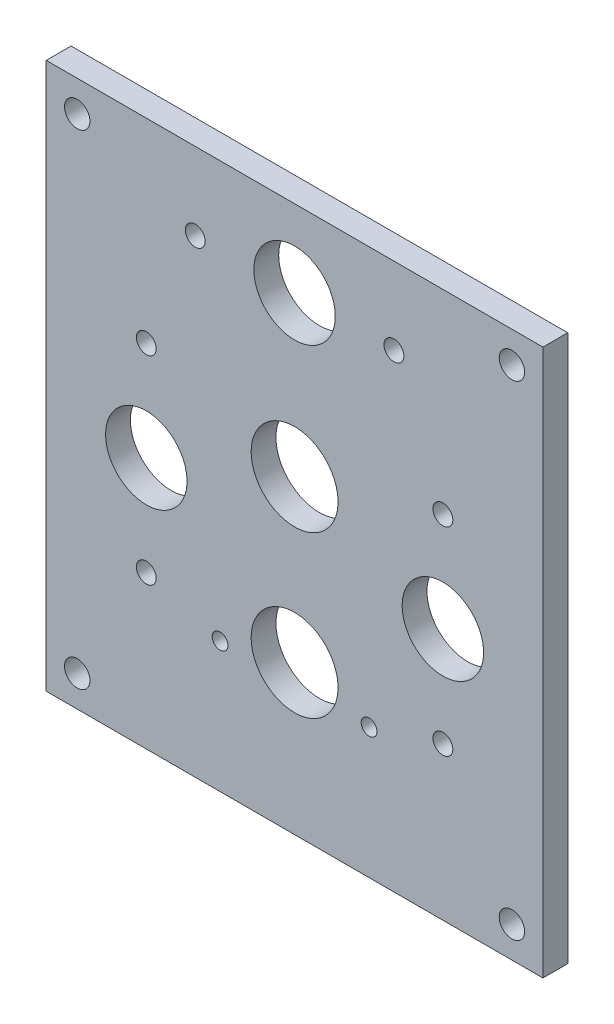
ISO-10303-21;
HEADER;
FILE_DESCRIPTION(('STEP AP214'),'2;1');
FILE_NAME('part.step','',(''),(''),'','','');
FILE_SCHEMA(('AUTOMOTIVE_DESIGN { 1 0 10303 214 1 1 1 1 }'));
ENDSEC;
DATA;
#1=APPLICATION_CONTEXT('core data for automotive mechanical design processes');
#2=APPLICATION_PROTOCOL_DEFINITION('international standard','automotive_design',2000,#1);
#3=PRODUCT_CONTEXT('',#1,'mechanical');
#4=PRODUCT('Part','Part','',(#3));
#5=PRODUCT_RELATED_PRODUCT_CATEGORY('part','',(#4));
#6=PRODUCT_DEFINITION_FORMATION('','',#4);
#7=PRODUCT_DEFINITION_CONTEXT('part definition',#1,'design');
#8=PRODUCT_DEFINITION('design','',#6,#7);
#9=PRODUCT_DEFINITION_SHAPE('','',#8);
#10=(LENGTH_UNIT() NAMED_UNIT(*) SI_UNIT(.MILLI.,.METRE.));
#11=(NAMED_UNIT(*) PLANE_ANGLE_UNIT() SI_UNIT($,.RADIAN.));
#12=(NAMED_UNIT(*) SI_UNIT($,.STERADIAN.) SOLID_ANGLE_UNIT());
#13=UNCERTAINTY_MEASURE_WITH_UNIT(LENGTH_MEASURE(1.E-05),#10,'distance_accuracy_value','');
#14=(GEOMETRIC_REPRESENTATION_CONTEXT(3) GLOBAL_UNCERTAINTY_ASSIGNED_CONTEXT((#13)) GLOBAL_UNIT_ASSIGNED_CONTEXT((#10,
#11,#12)) REPRESENTATION_CONTEXT('',''));
#15=CARTESIAN_POINT('',(0.,0.,0.));
#16=DIRECTION('',(0.,0.,1.));
#17=DIRECTION('',(1.,0.,0.));
#18=AXIS2_PLACEMENT_3D('',#15,#16,#17);
#19=CARTESIAN_POINT('',(63.5,-38.1,28.5749999999999));
#20=DIRECTION('',(0.,0.,-1.));
#21=DIRECTION('',(-1.,0.,0.));
#22=AXIS2_PLACEMENT_3D('',#19,#20,#21);
#23=PLANE('',#22);
#24=DIRECTION('',(0.,1.,0.));
#25=VECTOR('',#24,1.);
#26=CARTESIAN_POINT('',(-63.5,101.6,28.5749999999999));
#27=LINE('',#26,#25);
#28=CARTESIAN_POINT('',(-63.5,-38.1,28.5749999999999));
#29=VERTEX_POINT('',#28);
#30=CARTESIAN_POINT('',(-63.5,101.6,28.5749999999999));
#31=VERTEX_POINT('',#30);
#32=EDGE_CURVE('E55',#29,#31,#27,.T.);
#33=ORIENTED_EDGE('',*,*,#32,.T.);
#34=DIRECTION('',(1.,0.,0.));
#35=VECTOR('',#34,1.);
#36=CARTESIAN_POINT('',(63.5,101.6,28.5749999999999));
#37=LINE('',#36,#35);
#38=CARTESIAN_POINT('',(63.5,101.6,28.5749999999999));
#39=VERTEX_POINT('',#38);
#40=EDGE_CURVE('E499',#31,#39,#37,.T.);
#41=ORIENTED_EDGE('',*,*,#40,.T.);
#42=DIRECTION('',(0.,-1.,0.));
#43=VECTOR('',#42,1.);
#44=CARTESIAN_POINT('',(63.5,101.6,28.5749999999999));
#45=LINE('',#44,#43);
#46=CARTESIAN_POINT('',(63.5,-38.1,28.5749999999999));
#47=VERTEX_POINT('',#46);
#48=EDGE_CURVE('E60',#39,#47,#45,.T.);
#49=ORIENTED_EDGE('',*,*,#48,.T.);
#50=DIRECTION('',(-1.,0.,0.));
#51=VECTOR('',#50,1.);
#52=CARTESIAN_POINT('',(63.5,-38.1,28.5749999999999));
#53=LINE('',#52,#51);
#54=EDGE_CURVE('E58',#47,#29,#53,.T.);
#55=ORIENTED_EDGE('',*,*,#54,.T.);
#56=EDGE_LOOP('',(#33,#41,#49,#55));
#57=FACE_BOUND('',#56,.T.);
#58=CARTESIAN_POINT('',(0.,41.148,28.5749999999999));
#59=DIRECTION('',(0.,0.,-1.));
#60=DIRECTION('',(-1.,0.,0.));
#61=AXIS2_PLACEMENT_3D('',#58,#59,#60);
#62=CIRCLE('',#61,11.1125);
#63=CARTESIAN_POINT('',(-11.1125,41.148,28.5749999999999));
#64=VERTEX_POINT('',#63);
#65=EDGE_CURVE('E66',#64,#64,#62,.F.);
#66=ORIENTED_EDGE('',*,*,#65,.T.);
#67=EDGE_LOOP('',(#66));
#68=FACE_BOUND('',#67,.T.);
#69=CARTESIAN_POINT('',(0.,0.,28.5749999999999));
#70=DIRECTION('',(0.,0.,-1.));
#71=DIRECTION('',(-1.,0.,0.));
#72=AXIS2_PLACEMENT_3D('',#69,#70,#71);
#73=CIRCLE('',#72,11.1125);
#74=CARTESIAN_POINT('',(-11.1124999999999,0.,28.5749999999999));
#75=VERTEX_POINT('',#74);
#76=EDGE_CURVE('E135',#75,#75,#73,.F.);
#77=ORIENTED_EDGE('',*,*,#76,.T.);
#78=EDGE_LOOP('',(#77));
#79=FACE_BOUND('',#78,.T.);
#80=CARTESIAN_POINT('',(37.9152217386642,26.3771785892618,28.5749999999999));
#81=DIRECTION('',(0.,0.,-1.));
#82=DIRECTION('',(-1.,0.,0.));
#83=AXIS2_PLACEMENT_3D('',#80,#81,#82);
#84=CIRCLE('',#83,10.414);
#85=CARTESIAN_POINT('',(27.5012217386642,26.3771785892618,28.5749999999999));
#86=VERTEX_POINT('',#85);
#87=EDGE_CURVE('E138',#86,#86,#84,.F.);
#88=ORIENTED_EDGE('',*,*,#87,.T.);
#89=EDGE_LOOP('',(#88));
#90=FACE_BOUND('',#89,.T.);
#91=CARTESIAN_POINT('',(0.,81.8388,28.5749999999999));
#92=DIRECTION('',(0.,0.,-1.));
#93=DIRECTION('',(-1.,0.,0.));
#94=AXIS2_PLACEMENT_3D('',#91,#92,#93);
#95=CIRCLE('',#94,10.414);
#96=CARTESIAN_POINT('',(-10.414,81.8388,28.5749999999999));
#97=VERTEX_POINT('',#96);
#98=EDGE_CURVE('E141',#97,#97,#95,.F.);
#99=ORIENTED_EDGE('',*,*,#98,.T.);
#100=EDGE_LOOP('',(#99));
#101=FACE_BOUND('',#100,.T.);
#102=CARTESIAN_POINT('',(-37.9152217386642,26.3771785892618,28.5749999999999));
#103=DIRECTION('',(0.,0.,-1.));
#104=DIRECTION('',(-1.,0.,0.));
#105=AXIS2_PLACEMENT_3D('',#102,#103,#104);
#106=CIRCLE('',#105,10.414);
#107=CARTESIAN_POINT('',(-48.3292217386642,26.3771785892618,28.5749999999999));
#108=VERTEX_POINT('',#107);
#109=EDGE_CURVE('E144',#108,#108,#106,.F.);
#110=ORIENTED_EDGE('',*,*,#109,.T.);
#111=EDGE_LOOP('',(#110));
#112=FACE_BOUND('',#111,.T.);
#113=CARTESIAN_POINT('',(37.9152217386642,0.977178589261784,28.5749999999999));
#114=DIRECTION('',(0.,0.,-1.));
#115=DIRECTION('',(-1.,0.,0.));
#116=AXIS2_PLACEMENT_3D('',#113,#114,#115);
#117=CIRCLE('',#116,2.54);
#118=CARTESIAN_POINT('',(35.3752217386642,0.977178589261784,28.5749999999999));
#119=VERTEX_POINT('',#118);
#120=EDGE_CURVE('E147',#119,#119,#117,.F.);
#121=ORIENTED_EDGE('',*,*,#120,.T.);
#122=EDGE_LOOP('',(#121));
#123=FACE_BOUND('',#122,.T.);
#124=CARTESIAN_POINT('',(37.9152217386642,51.7771785892618,28.5749999999999));
#125=DIRECTION('',(0.,0.,-1.));
#126=DIRECTION('',(-1.,0.,0.));
#127=AXIS2_PLACEMENT_3D('',#124,#125,#126);
#128=CIRCLE('',#127,2.54);
#129=CARTESIAN_POINT('',(35.3752217386642,51.7771785892618,28.5749999999999));
#130=VERTEX_POINT('',#129);
#131=EDGE_CURVE('E150',#130,#130,#128,.F.);
#132=ORIENTED_EDGE('',*,*,#131,.T.);
#133=EDGE_LOOP('',(#132));
#134=FACE_BOUND('',#133,.T.);
#135=CARTESIAN_POINT('',(25.4,81.8388,28.5749999999999));
#136=DIRECTION('',(0.,0.,-1.));
#137=DIRECTION('',(-1.,0.,0.));
#138=AXIS2_PLACEMENT_3D('',#135,#136,#137);
#139=CIRCLE('',#138,2.53999999999999);
#140=CARTESIAN_POINT('',(22.86,81.8388,28.5749999999999));
#141=VERTEX_POINT('',#140);
#142=EDGE_CURVE('E153',#141,#141,#139,.F.);
#143=ORIENTED_EDGE('',*,*,#142,.T.);
#144=EDGE_LOOP('',(#143));
#145=FACE_BOUND('',#144,.T.);
#146=CARTESIAN_POINT('',(-25.4,81.8388,28.5749999999999));
#147=DIRECTION('',(0.,0.,-1.));
#148=DIRECTION('',(-1.,0.,0.));
#149=AXIS2_PLACEMENT_3D('',#146,#147,#148);
#150=CIRCLE('',#149,2.53999999999999);
#151=CARTESIAN_POINT('',(-27.94,81.8388,28.5749999999999));
#152=VERTEX_POINT('',#151);
#153=EDGE_CURVE('E156',#152,#152,#150,.F.);
#154=ORIENTED_EDGE('',*,*,#153,.T.);
#155=EDGE_LOOP('',(#154));
#156=FACE_BOUND('',#155,.T.);
#157=CARTESIAN_POINT('',(-37.9152217386642,51.7771785892618,28.5749999999999));
#158=DIRECTION('',(0.,0.,-1.));
#159=DIRECTION('',(-1.,0.,0.));
#160=AXIS2_PLACEMENT_3D('',#157,#158,#159);
#161=CIRCLE('',#160,2.54);
#162=CARTESIAN_POINT('',(-40.4552217386642,51.7771785892618,28.5749999999999));
#163=VERTEX_POINT('',#162);
#164=EDGE_CURVE('E159',#163,#163,#161,.F.);
#165=ORIENTED_EDGE('',*,*,#164,.T.);
#166=EDGE_LOOP('',(#165));
#167=FACE_BOUND('',#166,.T.);
#168=CARTESIAN_POINT('',(-37.9152217386642,0.977178589261808,28.5749999999999));
#169=DIRECTION('',(0.,0.,-1.));
#170=DIRECTION('',(-1.,0.,0.));
#171=AXIS2_PLACEMENT_3D('',#168,#169,#170);
#172=CIRCLE('',#171,2.54);
#173=CARTESIAN_POINT('',(-40.4552217386642,0.977178589261808,28.5749999999999));
#174=VERTEX_POINT('',#173);
#175=EDGE_CURVE('E162',#174,#174,#172,.F.);
#176=ORIENTED_EDGE('',*,*,#175,.T.);
#177=EDGE_LOOP('',(#176));
#178=FACE_BOUND('',#177,.T.);
#179=CARTESIAN_POINT('',(-19.05,-4.76249999999999,28.5749999999999));
#180=DIRECTION('',(0.,0.,1.));
#181=DIRECTION('',(1.,0.,0.));
#182=AXIS2_PLACEMENT_3D('',#179,#180,#181);
#183=CIRCLE('',#182,2.0193);
#184=CARTESIAN_POINT('',(-17.0307,-4.76249999999999,28.5749999999999));
#185=VERTEX_POINT('',#184);
#186=EDGE_CURVE('E165',#185,#185,#183,.T.);
#187=ORIENTED_EDGE('',*,*,#186,.T.);
#188=EDGE_LOOP('',(#187));
#189=FACE_BOUND('',#188,.T.);
#190=CARTESIAN_POINT('',(19.05,-4.76249999999999,28.5749999999999));
#191=DIRECTION('',(0.,0.,1.));
#192=DIRECTION('',(1.,0.,0.));
#193=AXIS2_PLACEMENT_3D('',#190,#191,#192);
#194=CIRCLE('',#193,2.0193);
#195=CARTESIAN_POINT('',(21.0693,-4.76249999999999,28.5749999999999));
#196=VERTEX_POINT('',#195);
#197=EDGE_CURVE('E168',#196,#196,#194,.T.);
#198=ORIENTED_EDGE('',*,*,#197,.T.);
#199=EDGE_LOOP('',(#198));
#200=FACE_BOUND('',#199,.T.);
#201=CARTESIAN_POINT('',(-55.5752000000001,-30.1752,28.5749999999999));
#202=DIRECTION('',(0.,0.,-1.));
#203=DIRECTION('',(-1.,0.,0.));
#204=AXIS2_PLACEMENT_3D('',#201,#202,#203);
#205=CIRCLE('',#204,3.2512);
#206=CARTESIAN_POINT('',(-58.8264000000001,-30.1752,28.5749999999999));
#207=VERTEX_POINT('',#206);
#208=EDGE_CURVE('E171',#207,#207,#205,.F.);
#209=ORIENTED_EDGE('',*,*,#208,.T.);
#210=EDGE_LOOP('',(#209));
#211=FACE_BOUND('',#210,.T.);
#212=CARTESIAN_POINT('',(55.5752,-30.1752,28.5749999999999));
#213=DIRECTION('',(0.,0.,-1.));
#214=DIRECTION('',(-1.,0.,0.));
#215=AXIS2_PLACEMENT_3D('',#212,#213,#214);
#216=CIRCLE('',#215,3.2512);
#217=CARTESIAN_POINT('',(52.324,-30.1752,28.5749999999999));
#218=VERTEX_POINT('',#217);
#219=EDGE_CURVE('E174',#218,#218,#216,.F.);
#220=ORIENTED_EDGE('',*,*,#219,.T.);
#221=EDGE_LOOP('',(#220));
#222=FACE_BOUND('',#221,.T.);
#223=CARTESIAN_POINT('',(55.5752,93.6752,28.5749999999999));
#224=DIRECTION('',(0.,0.,-1.));
#225=DIRECTION('',(-1.,0.,0.));
#226=AXIS2_PLACEMENT_3D('',#223,#224,#225);
#227=CIRCLE('',#226,3.25119999999999);
#228=CARTESIAN_POINT('',(52.324,93.6752,28.5749999999999));
#229=VERTEX_POINT('',#228);
#230=EDGE_CURVE('E176',#229,#229,#227,.F.);
#231=ORIENTED_EDGE('',*,*,#230,.T.);
#232=EDGE_LOOP('',(#231));
#233=FACE_BOUND('',#232,.T.);
#234=CARTESIAN_POINT('',(-55.5752,93.6752,28.5749999999999));
#235=DIRECTION('',(0.,0.,-1.));
#236=DIRECTION('',(-1.,0.,0.));
#237=AXIS2_PLACEMENT_3D('',#234,#235,#236);
#238=CIRCLE('',#237,3.2512);
#239=CARTESIAN_POINT('',(-58.8264,93.6752,28.5749999999999));
#240=VERTEX_POINT('',#239);
#241=EDGE_CURVE('E20',#240,#240,#238,.F.);
#242=ORIENTED_EDGE('',*,*,#241,.T.);
#243=EDGE_LOOP('',(#242));
#244=FACE_BOUND('',#243,.T.);
#245=ADVANCED_FACE('F17',(#57,#68,#79,#90,#101,#112,#123,#134,#145,#156,#167,#178,#189,#200,
#211,#222,#233,#244),#23,.T.);
#246=CARTESIAN_POINT('',(-55.5752,93.6752,34.9249999999999));
#247=DIRECTION('',(0.,0.,-1.));
#248=DIRECTION('',(-1.,0.,0.));
#249=AXIS2_PLACEMENT_3D('',#246,#247,#248);
#250=CYLINDRICAL_SURFACE('',#249,3.2512);
#251=CARTESIAN_POINT('',(-55.5752,93.6752,34.9249999999999));
#252=DIRECTION('',(0.,0.,-1.));
#253=DIRECTION('',(-1.,0.,0.));
#254=AXIS2_PLACEMENT_3D('',#251,#252,#253);
#255=CIRCLE('',#254,3.2512);
#256=CARTESIAN_POINT('',(-58.8264,93.6752,34.9249999999999));
#257=VERTEX_POINT('',#256);
#258=EDGE_CURVE('E129',#257,#257,#255,.F.);
#259=ORIENTED_EDGE('',*,*,#258,.T.);
#260=EDGE_LOOP('',(#259));
#261=FACE_BOUND('',#260,.T.);
#262=ORIENTED_EDGE('',*,*,#241,.F.);
#263=EDGE_LOOP('',(#262));
#264=FACE_BOUND('',#263,.T.);
#265=ADVANCED_FACE('F184',(#261,#264),#250,.F.);
#266=CARTESIAN_POINT('',(55.5752,93.6752,34.9249999999999));
#267=DIRECTION('',(0.,0.,-1.));
#268=DIRECTION('',(-1.,0.,0.));
#269=AXIS2_PLACEMENT_3D('',#266,#267,#268);
#270=CYLINDRICAL_SURFACE('',#269,3.25119999999999);
#271=CARTESIAN_POINT('',(55.5752,93.6752,34.9249999999999));
#272=DIRECTION('',(0.,0.,-1.));
#273=DIRECTION('',(-1.,0.,0.));
#274=AXIS2_PLACEMENT_3D('',#271,#272,#273);
#275=CIRCLE('',#274,3.25119999999999);
#276=CARTESIAN_POINT('',(52.324,93.6752,34.9249999999999));
#277=VERTEX_POINT('',#276);
#278=EDGE_CURVE('E126',#277,#277,#275,.F.);
#279=ORIENTED_EDGE('',*,*,#278,.T.);
#280=EDGE_LOOP('',(#279));
#281=FACE_BOUND('',#280,.T.);
#282=ORIENTED_EDGE('',*,*,#230,.F.);
#283=EDGE_LOOP('',(#282));
#284=FACE_BOUND('',#283,.T.);
#285=ADVANCED_FACE('F186',(#281,#284),#270,.F.);
#286=CARTESIAN_POINT('',(55.5752,-30.1752,34.9249999999999));
#287=DIRECTION('',(0.,0.,-1.));
#288=DIRECTION('',(-1.,0.,0.));
#289=AXIS2_PLACEMENT_3D('',#286,#287,#288);
#290=CYLINDRICAL_SURFACE('',#289,3.2512);
#291=CARTESIAN_POINT('',(55.5752,-30.1752,34.9249999999999));
#292=DIRECTION('',(0.,0.,-1.));
#293=DIRECTION('',(-1.,0.,0.));
#294=AXIS2_PLACEMENT_3D('',#291,#292,#293);
#295=CIRCLE('',#294,3.2512);
#296=CARTESIAN_POINT('',(52.324,-30.1752,34.9249999999999));
#297=VERTEX_POINT('',#296);
#298=EDGE_CURVE('E123',#297,#297,#295,.F.);
#299=ORIENTED_EDGE('',*,*,#298,.T.);
#300=EDGE_LOOP('',(#299));
#301=FACE_BOUND('',#300,.T.);
#302=ORIENTED_EDGE('',*,*,#219,.F.);
#303=EDGE_LOOP('',(#302));
#304=FACE_BOUND('',#303,.T.);
#305=ADVANCED_FACE('F193',(#301,#304),#290,.F.);
#306=CARTESIAN_POINT('',(-55.5752000000001,-30.1752,34.9249999999999));
#307=DIRECTION('',(0.,0.,-1.));
#308=DIRECTION('',(-1.,0.,0.));
#309=AXIS2_PLACEMENT_3D('',#306,#307,#308);
#310=CYLINDRICAL_SURFACE('',#309,3.2512);
#311=CARTESIAN_POINT('',(-55.5752000000001,-30.1752,34.9249999999999));
#312=DIRECTION('',(0.,0.,-1.));
#313=DIRECTION('',(-1.,0.,0.));
#314=AXIS2_PLACEMENT_3D('',#311,#312,#313);
#315=CIRCLE('',#314,3.2512);
#316=CARTESIAN_POINT('',(-58.8264000000001,-30.1752,34.9249999999999));
#317=VERTEX_POINT('',#316);
#318=EDGE_CURVE('E120',#317,#317,#315,.F.);
#319=ORIENTED_EDGE('',*,*,#318,.T.);
#320=EDGE_LOOP('',(#319));
#321=FACE_BOUND('',#320,.T.);
#322=ORIENTED_EDGE('',*,*,#208,.F.);
#323=EDGE_LOOP('',(#322));
#324=FACE_BOUND('',#323,.T.);
#325=ADVANCED_FACE('F267',(#321,#324),#310,.F.);
#326=CARTESIAN_POINT('',(19.05,-4.76249999999999,28.5749999999999));
#327=DIRECTION('',(0.,0.,1.));
#328=DIRECTION('',(1.,0.,0.));
#329=AXIS2_PLACEMENT_3D('',#326,#327,#328);
#330=CYLINDRICAL_SURFACE('',#329,2.0193);
#331=ORIENTED_EDGE('',*,*,#197,.F.);
#332=EDGE_LOOP('',(#331));
#333=FACE_BOUND('',#332,.T.);
#334=CARTESIAN_POINT('',(19.05,-4.76249999999999,34.9249999999999));
#335=DIRECTION('',(0.,0.,1.));
#336=DIRECTION('',(1.,0.,0.));
#337=AXIS2_PLACEMENT_3D('',#334,#335,#336);
#338=CIRCLE('',#337,2.0193);
#339=CARTESIAN_POINT('',(21.0693,-4.76249999999999,34.9249999999999));
#340=VERTEX_POINT('',#339);
#341=EDGE_CURVE('E117',#340,#340,#338,.T.);
#342=ORIENTED_EDGE('',*,*,#341,.T.);
#343=EDGE_LOOP('',(#342));
#344=FACE_BOUND('',#343,.T.);
#345=ADVANCED_FACE('F263',(#333,#344),#330,.F.);
#346=CARTESIAN_POINT('',(-19.05,-4.76249999999999,28.5749999999999));
#347=DIRECTION('',(0.,0.,1.));
#348=DIRECTION('',(1.,0.,0.));
#349=AXIS2_PLACEMENT_3D('',#346,#347,#348);
#350=CYLINDRICAL_SURFACE('',#349,2.0193);
#351=ORIENTED_EDGE('',*,*,#186,.F.);
#352=EDGE_LOOP('',(#351));
#353=FACE_BOUND('',#352,.T.);
#354=CARTESIAN_POINT('',(-19.05,-4.76249999999999,34.9249999999999));
#355=DIRECTION('',(0.,0.,1.));
#356=DIRECTION('',(1.,0.,0.));
#357=AXIS2_PLACEMENT_3D('',#354,#355,#356);
#358=CIRCLE('',#357,2.0193);
#359=CARTESIAN_POINT('',(-17.0307,-4.76249999999999,34.9249999999999));
#360=VERTEX_POINT('',#359);
#361=EDGE_CURVE('E114',#360,#360,#358,.T.);
#362=ORIENTED_EDGE('',*,*,#361,.T.);
#363=EDGE_LOOP('',(#362));
#364=FACE_BOUND('',#363,.T.);
#365=ADVANCED_FACE('F259',(#353,#364),#350,.F.);
#366=CARTESIAN_POINT('',(-37.9152217386642,0.977178589261808,34.9249999999999));
#367=DIRECTION('',(0.,0.,-1.));
#368=DIRECTION('',(-1.,0.,0.));
#369=AXIS2_PLACEMENT_3D('',#366,#367,#368);
#370=CYLINDRICAL_SURFACE('',#369,2.54);
#371=CARTESIAN_POINT('',(-37.9152217386642,0.977178589261808,34.9249999999999));
#372=DIRECTION('',(0.,0.,-1.));
#373=DIRECTION('',(-1.,0.,0.));
#374=AXIS2_PLACEMENT_3D('',#371,#372,#373);
#375=CIRCLE('',#374,2.54);
#376=CARTESIAN_POINT('',(-40.4552217386642,0.977178589261808,34.9249999999999));
#377=VERTEX_POINT('',#376);
#378=EDGE_CURVE('E111',#377,#377,#375,.F.);
#379=ORIENTED_EDGE('',*,*,#378,.T.);
#380=EDGE_LOOP('',(#379));
#381=FACE_BOUND('',#380,.T.);
#382=ORIENTED_EDGE('',*,*,#175,.F.);
#383=EDGE_LOOP('',(#382));
#384=FACE_BOUND('',#383,.T.);
#385=ADVANCED_FACE('F255',(#381,#384),#370,.F.);
#386=CARTESIAN_POINT('',(-37.9152217386642,51.7771785892618,34.9249999999999));
#387=DIRECTION('',(0.,0.,-1.));
#388=DIRECTION('',(-1.,0.,0.));
#389=AXIS2_PLACEMENT_3D('',#386,#387,#388);
#390=CYLINDRICAL_SURFACE('',#389,2.54);
#391=CARTESIAN_POINT('',(-37.9152217386642,51.7771785892618,34.9249999999999));
#392=DIRECTION('',(0.,0.,-1.));
#393=DIRECTION('',(-1.,0.,0.));
#394=AXIS2_PLACEMENT_3D('',#391,#392,#393);
#395=CIRCLE('',#394,2.54);
#396=CARTESIAN_POINT('',(-40.4552217386642,51.7771785892618,34.9249999999999));
#397=VERTEX_POINT('',#396);
#398=EDGE_CURVE('E108',#397,#397,#395,.F.);
#399=ORIENTED_EDGE('',*,*,#398,.T.);
#400=EDGE_LOOP('',(#399));
#401=FACE_BOUND('',#400,.T.);
#402=ORIENTED_EDGE('',*,*,#164,.F.);
#403=EDGE_LOOP('',(#402));
#404=FACE_BOUND('',#403,.T.);
#405=ADVANCED_FACE('F251',(#401,#404),#390,.F.);
#406=CARTESIAN_POINT('',(-25.4,81.8388,34.9249999999999));
#407=DIRECTION('',(0.,0.,-1.));
#408=DIRECTION('',(-1.,0.,0.));
#409=AXIS2_PLACEMENT_3D('',#406,#407,#408);
#410=CYLINDRICAL_SURFACE('',#409,2.53999999999999);
#411=CARTESIAN_POINT('',(-25.4,81.8388,34.9249999999999));
#412=DIRECTION('',(0.,0.,-1.));
#413=DIRECTION('',(-1.,0.,0.));
#414=AXIS2_PLACEMENT_3D('',#411,#412,#413);
#415=CIRCLE('',#414,2.53999999999999);
#416=CARTESIAN_POINT('',(-27.94,81.8388,34.9249999999999));
#417=VERTEX_POINT('',#416);
#418=EDGE_CURVE('E105',#417,#417,#415,.F.);
#419=ORIENTED_EDGE('',*,*,#418,.T.);
#420=EDGE_LOOP('',(#419));
#421=FACE_BOUND('',#420,.T.);
#422=ORIENTED_EDGE('',*,*,#153,.F.);
#423=EDGE_LOOP('',(#422));
#424=FACE_BOUND('',#423,.T.);
#425=ADVANCED_FACE('F247',(#421,#424),#410,.F.);
#426=CARTESIAN_POINT('',(25.4,81.8388,34.9249999999999));
#427=DIRECTION('',(0.,0.,-1.));
#428=DIRECTION('',(-1.,0.,0.));
#429=AXIS2_PLACEMENT_3D('',#426,#427,#428);
#430=CYLINDRICAL_SURFACE('',#429,2.53999999999999);
#431=CARTESIAN_POINT('',(25.4,81.8388,34.9249999999999));
#432=DIRECTION('',(0.,0.,-1.));
#433=DIRECTION('',(-1.,0.,0.));
#434=AXIS2_PLACEMENT_3D('',#431,#432,#433);
#435=CIRCLE('',#434,2.53999999999999);
#436=CARTESIAN_POINT('',(22.86,81.8388,34.9249999999999));
#437=VERTEX_POINT('',#436);
#438=EDGE_CURVE('E102',#437,#437,#435,.F.);
#439=ORIENTED_EDGE('',*,*,#438,.T.);
#440=EDGE_LOOP('',(#439));
#441=FACE_BOUND('',#440,.T.);
#442=ORIENTED_EDGE('',*,*,#142,.F.);
#443=EDGE_LOOP('',(#442));
#444=FACE_BOUND('',#443,.T.);
#445=ADVANCED_FACE('F243',(#441,#444),#430,.F.);
#446=CARTESIAN_POINT('',(37.9152217386642,51.7771785892618,34.9249999999999));
#447=DIRECTION('',(0.,0.,-1.));
#448=DIRECTION('',(-1.,0.,0.));
#449=AXIS2_PLACEMENT_3D('',#446,#447,#448);
#450=CYLINDRICAL_SURFACE('',#449,2.54);
#451=CARTESIAN_POINT('',(37.9152217386642,51.7771785892618,34.9249999999999));
#452=DIRECTION('',(0.,0.,-1.));
#453=DIRECTION('',(-1.,0.,0.));
#454=AXIS2_PLACEMENT_3D('',#451,#452,#453);
#455=CIRCLE('',#454,2.54);
#456=CARTESIAN_POINT('',(35.3752217386642,51.7771785892618,34.9249999999999));
#457=VERTEX_POINT('',#456);
#458=EDGE_CURVE('E99',#457,#457,#455,.F.);
#459=ORIENTED_EDGE('',*,*,#458,.T.);
#460=EDGE_LOOP('',(#459));
#461=FACE_BOUND('',#460,.T.);
#462=ORIENTED_EDGE('',*,*,#131,.F.);
#463=EDGE_LOOP('',(#462));
#464=FACE_BOUND('',#463,.T.);
#465=ADVANCED_FACE('F239',(#461,#464),#450,.F.);
#466=CARTESIAN_POINT('',(37.9152217386642,0.977178589261784,34.9249999999999));
#467=DIRECTION('',(0.,0.,-1.));
#468=DIRECTION('',(-1.,0.,0.));
#469=AXIS2_PLACEMENT_3D('',#466,#467,#468);
#470=CYLINDRICAL_SURFACE('',#469,2.54);
#471=CARTESIAN_POINT('',(37.9152217386642,0.977178589261784,34.9249999999999));
#472=DIRECTION('',(0.,0.,-1.));
#473=DIRECTION('',(-1.,0.,0.));
#474=AXIS2_PLACEMENT_3D('',#471,#472,#473);
#475=CIRCLE('',#474,2.54);
#476=CARTESIAN_POINT('',(35.3752217386642,0.977178589261784,34.9249999999999));
#477=VERTEX_POINT('',#476);
#478=EDGE_CURVE('E96',#477,#477,#475,.F.);
#479=ORIENTED_EDGE('',*,*,#478,.T.);
#480=EDGE_LOOP('',(#479));
#481=FACE_BOUND('',#480,.T.);
#482=ORIENTED_EDGE('',*,*,#120,.F.);
#483=EDGE_LOOP('',(#482));
#484=FACE_BOUND('',#483,.T.);
#485=ADVANCED_FACE('F235',(#481,#484),#470,.F.);
#486=CARTESIAN_POINT('',(-37.9152217386642,26.3771785892618,34.9249999999999));
#487=DIRECTION('',(0.,0.,-1.));
#488=DIRECTION('',(-1.,0.,0.));
#489=AXIS2_PLACEMENT_3D('',#486,#487,#488);
#490=CYLINDRICAL_SURFACE('',#489,10.414);
#491=CARTESIAN_POINT('',(-37.9152217386642,26.3771785892618,34.9249999999999));
#492=DIRECTION('',(0.,0.,-1.));
#493=DIRECTION('',(-1.,0.,0.));
#494=AXIS2_PLACEMENT_3D('',#491,#492,#493);
#495=CIRCLE('',#494,10.414);
#496=CARTESIAN_POINT('',(-48.3292217386642,26.3771785892618,34.9249999999999));
#497=VERTEX_POINT('',#496);
#498=EDGE_CURVE('E93',#497,#497,#495,.F.);
#499=ORIENTED_EDGE('',*,*,#498,.T.);
#500=EDGE_LOOP('',(#499));
#501=FACE_BOUND('',#500,.T.);
#502=ORIENTED_EDGE('',*,*,#109,.F.);
#503=EDGE_LOOP('',(#502));
#504=FACE_BOUND('',#503,.T.);
#505=ADVANCED_FACE('F231',(#501,#504),#490,.F.);
#506=CARTESIAN_POINT('',(0.,81.8388,34.9249999999999));
#507=DIRECTION('',(0.,0.,-1.));
#508=DIRECTION('',(-1.,0.,0.));
#509=AXIS2_PLACEMENT_3D('',#506,#507,#508);
#510=CYLINDRICAL_SURFACE('',#509,10.414);
#511=CARTESIAN_POINT('',(0.,81.8388,34.9249999999999));
#512=DIRECTION('',(0.,0.,-1.));
#513=DIRECTION('',(-1.,0.,0.));
#514=AXIS2_PLACEMENT_3D('',#511,#512,#513);
#515=CIRCLE('',#514,10.414);
#516=CARTESIAN_POINT('',(-10.414,81.8388,34.9249999999999));
#517=VERTEX_POINT('',#516);
#518=EDGE_CURVE('E90',#517,#517,#515,.F.);
#519=ORIENTED_EDGE('',*,*,#518,.T.);
#520=EDGE_LOOP('',(#519));
#521=FACE_BOUND('',#520,.T.);
#522=ORIENTED_EDGE('',*,*,#98,.F.);
#523=EDGE_LOOP('',(#522));
#524=FACE_BOUND('',#523,.T.);
#525=ADVANCED_FACE('F227',(#521,#524),#510,.F.);
#526=CARTESIAN_POINT('',(37.9152217386642,26.3771785892618,34.9249999999999));
#527=DIRECTION('',(0.,0.,-1.));
#528=DIRECTION('',(-1.,0.,0.));
#529=AXIS2_PLACEMENT_3D('',#526,#527,#528);
#530=CYLINDRICAL_SURFACE('',#529,10.414);
#531=CARTESIAN_POINT('',(37.9152217386642,26.3771785892618,34.9249999999999));
#532=DIRECTION('',(0.,0.,-1.));
#533=DIRECTION('',(-1.,0.,0.));
#534=AXIS2_PLACEMENT_3D('',#531,#532,#533);
#535=CIRCLE('',#534,10.414);
#536=CARTESIAN_POINT('',(27.5012217386642,26.3771785892618,34.9249999999999));
#537=VERTEX_POINT('',#536);
#538=EDGE_CURVE('E87',#537,#537,#535,.F.);
#539=ORIENTED_EDGE('',*,*,#538,.T.);
#540=EDGE_LOOP('',(#539));
#541=FACE_BOUND('',#540,.T.);
#542=ORIENTED_EDGE('',*,*,#87,.F.);
#543=EDGE_LOOP('',(#542));
#544=FACE_BOUND('',#543,.T.);
#545=ADVANCED_FACE('F223',(#541,#544),#530,.F.);
#546=CARTESIAN_POINT('',(0.,0.,34.9249999999999));
#547=DIRECTION('',(0.,0.,-1.));
#548=DIRECTION('',(-1.,0.,0.));
#549=AXIS2_PLACEMENT_3D('',#546,#547,#548);
#550=CYLINDRICAL_SURFACE('',#549,11.1125);
#551=CARTESIAN_POINT('',(0.,0.,34.9249999999999));
#552=DIRECTION('',(0.,0.,-1.));
#553=DIRECTION('',(-1.,0.,0.));
#554=AXIS2_PLACEMENT_3D('',#551,#552,#553);
#555=CIRCLE('',#554,11.1125);
#556=CARTESIAN_POINT('',(-11.1124999999999,0.,34.9249999999999));
#557=VERTEX_POINT('',#556);
#558=EDGE_CURVE('E84',#557,#557,#555,.F.);
#559=ORIENTED_EDGE('',*,*,#558,.T.);
#560=EDGE_LOOP('',(#559));
#561=FACE_BOUND('',#560,.T.);
#562=ORIENTED_EDGE('',*,*,#76,.F.);
#563=EDGE_LOOP('',(#562));
#564=FACE_BOUND('',#563,.T.);
#565=ADVANCED_FACE('F219',(#561,#564),#550,.F.);
#566=CARTESIAN_POINT('',(0.,41.148,34.9249999999999));
#567=DIRECTION('',(0.,0.,-1.));
#568=DIRECTION('',(-1.,0.,0.));
#569=AXIS2_PLACEMENT_3D('',#566,#567,#568);
#570=CYLINDRICAL_SURFACE('',#569,11.1125);
#571=CARTESIAN_POINT('',(0.,41.148,34.9249999999999));
#572=DIRECTION('',(0.,0.,-1.));
#573=DIRECTION('',(-1.,0.,0.));
#574=AXIS2_PLACEMENT_3D('',#571,#572,#573);
#575=CIRCLE('',#574,11.1125);
#576=CARTESIAN_POINT('',(-11.1125,41.148,34.9249999999999));
#577=VERTEX_POINT('',#576);
#578=EDGE_CURVE('E81',#577,#577,#575,.F.);
#579=ORIENTED_EDGE('',*,*,#578,.T.);
#580=EDGE_LOOP('',(#579));
#581=FACE_BOUND('',#580,.T.);
#582=ORIENTED_EDGE('',*,*,#65,.F.);
#583=EDGE_LOOP('',(#582));
#584=FACE_BOUND('',#583,.T.);
#585=ADVANCED_FACE('F216',(#581,#584),#570,.F.);
#586=CARTESIAN_POINT('',(63.5,-38.1,28.5749999999999));
#587=DIRECTION('',(0.,1.,0.));
#588=DIRECTION('',(-1.,0.,0.));
#589=AXIS2_PLACEMENT_3D('',#586,#587,#588);
#590=PLANE('',#589);
#591=DIRECTION('',(0.,0.,1.));
#592=VECTOR('',#591,1.);
#593=CARTESIAN_POINT('',(-63.5,-38.1,28.5749999999999));
#594=LINE('',#593,#592);
#595=CARTESIAN_POINT('',(-63.5,-38.1,34.9249999999999));
#596=VERTEX_POINT('',#595);
#597=EDGE_CURVE('E65',#596,#29,#594,.F.);
#598=ORIENTED_EDGE('',*,*,#597,.T.);
#599=ORIENTED_EDGE('',*,*,#54,.F.);
#600=DIRECTION('',(0.,0.,1.));
#601=VECTOR('',#600,1.);
#602=CARTESIAN_POINT('',(63.5,-38.1,28.5749999999999));
#603=LINE('',#602,#601);
#604=CARTESIAN_POINT('',(63.5,-38.1,34.9249999999999));
#605=VERTEX_POINT('',#604);
#606=EDGE_CURVE('E132',#47,#605,#603,.T.);
#607=ORIENTED_EDGE('',*,*,#606,.T.);
#608=DIRECTION('',(-1.,0.,0.));
#609=VECTOR('',#608,1.);
#610=CARTESIAN_POINT('',(63.5,-38.1,34.9249999999999));
#611=LINE('',#610,#609);
#612=EDGE_CURVE('E77',#605,#596,#611,.T.);
#613=ORIENTED_EDGE('',*,*,#612,.T.);
#614=EDGE_LOOP('',(#598,#599,#607,#613));
#615=FACE_BOUND('',#614,.T.);
#616=ADVANCED_FACE('F76',(#615),#590,.F.);
#617=CARTESIAN_POINT('',(-63.5,101.6,28.5749999999999));
#618=DIRECTION('',(1.,0.,0.));
#619=DIRECTION('',(0.,1.,0.));
#620=AXIS2_PLACEMENT_3D('',#617,#618,#619);
#621=PLANE('',#620);
#622=DIRECTION('',(0.,0.,1.));
#623=VECTOR('',#622,1.);
#624=CARTESIAN_POINT('',(-63.5,101.6,28.5749999999999));
#625=LINE('',#624,#623);
#626=CARTESIAN_POINT('',(-63.5,101.6,34.9249999999999));
#627=VERTEX_POINT('',#626);
#628=EDGE_CURVE('E73',#627,#31,#625,.F.);
#629=ORIENTED_EDGE('',*,*,#628,.T.);
#630=ORIENTED_EDGE('',*,*,#32,.F.);
#631=ORIENTED_EDGE('',*,*,#597,.F.);
#632=DIRECTION('',(0.,1.,0.));
#633=VECTOR('',#632,1.);
#634=CARTESIAN_POINT('',(-63.5,-38.1,34.9249999999999));
#635=LINE('',#634,#633);
#636=EDGE_CURVE('E506',#596,#627,#635,.T.);
#637=ORIENTED_EDGE('',*,*,#636,.T.);
#638=EDGE_LOOP('',(#629,#630,#631,#637));
#639=FACE_BOUND('',#638,.T.);
#640=ADVANCED_FACE('F70',(#639),#621,.F.);
#641=CARTESIAN_POINT('',(63.5,101.6,28.5749999999999));
#642=DIRECTION('',(0.,-1.,0.));
#643=DIRECTION('',(1.,0.,0.));
#644=AXIS2_PLACEMENT_3D('',#641,#642,#643);
#645=PLANE('',#644);
#646=DIRECTION('',(0.,0.,1.));
#647=VECTOR('',#646,1.);
#648=CARTESIAN_POINT('',(63.5,101.6,28.5749999999999));
#649=LINE('',#648,#647);
#650=CARTESIAN_POINT('',(63.5,101.6,34.9249999999999));
#651=VERTEX_POINT('',#650);
#652=EDGE_CURVE('E34',#651,#39,#649,.F.);
#653=ORIENTED_EDGE('',*,*,#652,.T.);
#654=ORIENTED_EDGE('',*,*,#40,.F.);
#655=ORIENTED_EDGE('',*,*,#628,.F.);
#656=DIRECTION('',(-1.,0.,0.));
#657=VECTOR('',#656,1.);
#658=CARTESIAN_POINT('',(63.5,101.6,34.9249999999999));
#659=LINE('',#658,#657);
#660=EDGE_CURVE('E26',#627,#651,#659,.F.);
#661=ORIENTED_EDGE('',*,*,#660,.T.);
#662=EDGE_LOOP('',(#653,#654,#655,#661));
#663=FACE_BOUND('',#662,.T.);
#664=ADVANCED_FACE('F204',(#663),#645,.F.);
#665=CARTESIAN_POINT('',(63.5,101.6,28.5749999999999));
#666=DIRECTION('',(-1.,0.,0.));
#667=DIRECTION('',(0.,-1.,0.));
#668=AXIS2_PLACEMENT_3D('',#665,#666,#667);
#669=PLANE('',#668);
#670=ORIENTED_EDGE('',*,*,#606,.F.);
#671=ORIENTED_EDGE('',*,*,#48,.F.);
#672=ORIENTED_EDGE('',*,*,#652,.F.);
#673=DIRECTION('',(0.,1.,0.));
#674=VECTOR('',#673,1.);
#675=CARTESIAN_POINT('',(63.5,-38.1,34.9249999999999));
#676=LINE('',#675,#674);
#677=EDGE_CURVE('E11',#651,#605,#676,.F.);
#678=ORIENTED_EDGE('',*,*,#677,.T.);
#679=EDGE_LOOP('',(#670,#671,#672,#678));
#680=FACE_BOUND('',#679,.T.);
#681=ADVANCED_FACE('F198',(#680),#669,.F.);
#682=CARTESIAN_POINT('',(63.5,-38.1,34.9249999999999));
#683=DIRECTION('',(0.,0.,-1.));
#684=DIRECTION('',(-1.,0.,0.));
#685=AXIS2_PLACEMENT_3D('',#682,#683,#684);
#686=PLANE('',#685);
#687=ORIENTED_EDGE('',*,*,#660,.F.);
#688=ORIENTED_EDGE('',*,*,#636,.F.);
#689=ORIENTED_EDGE('',*,*,#612,.F.);
#690=ORIENTED_EDGE('',*,*,#677,.F.);
#691=EDGE_LOOP('',(#687,#688,#689,#690));
#692=FACE_BOUND('',#691,.T.);
#693=ORIENTED_EDGE('',*,*,#578,.F.);
#694=EDGE_LOOP('',(#693));
#695=FACE_BOUND('',#694,.T.);
#696=ORIENTED_EDGE('',*,*,#558,.F.);
#697=EDGE_LOOP('',(#696));
#698=FACE_BOUND('',#697,.T.);
#699=ORIENTED_EDGE('',*,*,#538,.F.);
#700=EDGE_LOOP('',(#699));
#701=FACE_BOUND('',#700,.T.);
#702=ORIENTED_EDGE('',*,*,#518,.F.);
#703=EDGE_LOOP('',(#702));
#704=FACE_BOUND('',#703,.T.);
#705=ORIENTED_EDGE('',*,*,#498,.F.);
#706=EDGE_LOOP('',(#705));
#707=FACE_BOUND('',#706,.T.);
#708=ORIENTED_EDGE('',*,*,#478,.F.);
#709=EDGE_LOOP('',(#708));
#710=FACE_BOUND('',#709,.T.);
#711=ORIENTED_EDGE('',*,*,#458,.F.);
#712=EDGE_LOOP('',(#711));
#713=FACE_BOUND('',#712,.T.);
#714=ORIENTED_EDGE('',*,*,#438,.F.);
#715=EDGE_LOOP('',(#714));
#716=FACE_BOUND('',#715,.T.);
#717=ORIENTED_EDGE('',*,*,#418,.F.);
#718=EDGE_LOOP('',(#717));
#719=FACE_BOUND('',#718,.T.);
#720=ORIENTED_EDGE('',*,*,#398,.F.);
#721=EDGE_LOOP('',(#720));
#722=FACE_BOUND('',#721,.T.);
#723=ORIENTED_EDGE('',*,*,#378,.F.);
#724=EDGE_LOOP('',(#723));
#725=FACE_BOUND('',#724,.T.);
#726=ORIENTED_EDGE('',*,*,#361,.F.);
#727=EDGE_LOOP('',(#726));
#728=FACE_BOUND('',#727,.T.);
#729=ORIENTED_EDGE('',*,*,#341,.F.);
#730=EDGE_LOOP('',(#729));
#731=FACE_BOUND('',#730,.T.);
#732=ORIENTED_EDGE('',*,*,#318,.F.);
#733=EDGE_LOOP('',(#732));
#734=FACE_BOUND('',#733,.T.);
#735=ORIENTED_EDGE('',*,*,#298,.F.);
#736=EDGE_LOOP('',(#735));
#737=FACE_BOUND('',#736,.T.);
#738=ORIENTED_EDGE('',*,*,#278,.F.);
#739=EDGE_LOOP('',(#738));
#740=FACE_BOUND('',#739,.T.);
#741=ORIENTED_EDGE('',*,*,#258,.F.);
#742=EDGE_LOOP('',(#741));
#743=FACE_BOUND('',#742,.T.);
#744=ADVANCED_FACE('F196',(#692,#695,#698,#701,#704,#707,#710,#713,#716,#719,#722,#725,#728,
#731,#734,#737,#740,#743),#686,.F.);
#745=CLOSED_SHELL('',(#245,#265,#285,#305,#325,#345,#365,#385,#405,#425,#445,#465,#485,#505,
#525,#545,#565,#585,#616,#640,#664,#681,#744));
#746=MANIFOLD_SOLID_BREP('B1',#745);
#747=ADVANCED_BREP_SHAPE_REPRESENTATION('',(#18,#746),#14);
#748=SHAPE_DEFINITION_REPRESENTATION(#9,#747);
ENDSEC;
END-ISO-10303-21;
